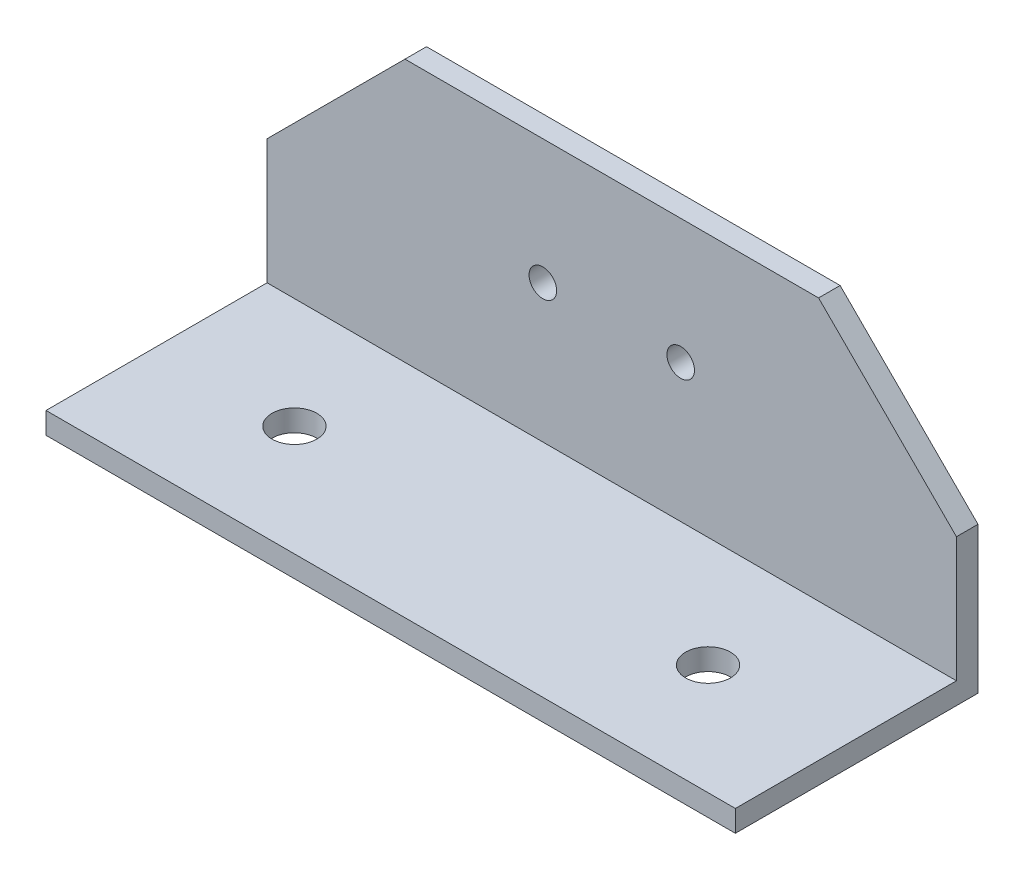
ISO-10303-21;
HEADER;
FILE_DESCRIPTION(('STEP AP214'),'2;1');
FILE_NAME('part.step','',(''),(''),'','','');
FILE_SCHEMA(('AUTOMOTIVE_DESIGN { 1 0 10303 214 1 1 1 1 }'));
ENDSEC;
DATA;
#1=APPLICATION_CONTEXT('core data for automotive mechanical design processes');
#2=APPLICATION_PROTOCOL_DEFINITION('international standard','automotive_design',2000,#1);
#3=PRODUCT_CONTEXT('',#1,'mechanical');
#4=PRODUCT('Part','Part','',(#3));
#5=PRODUCT_RELATED_PRODUCT_CATEGORY('part','',(#4));
#6=PRODUCT_DEFINITION_FORMATION('','',#4);
#7=PRODUCT_DEFINITION_CONTEXT('part definition',#1,'design');
#8=PRODUCT_DEFINITION('design','',#6,#7);
#9=PRODUCT_DEFINITION_SHAPE('','',#8);
#10=(LENGTH_UNIT() NAMED_UNIT(*) SI_UNIT(.MILLI.,.METRE.));
#11=(NAMED_UNIT(*) PLANE_ANGLE_UNIT() SI_UNIT($,.RADIAN.));
#12=(NAMED_UNIT(*) SI_UNIT($,.STERADIAN.) SOLID_ANGLE_UNIT());
#13=UNCERTAINTY_MEASURE_WITH_UNIT(LENGTH_MEASURE(1.E-05),#10,'distance_accuracy_value','');
#14=(GEOMETRIC_REPRESENTATION_CONTEXT(3) GLOBAL_UNCERTAINTY_ASSIGNED_CONTEXT((#13)) GLOBAL_UNIT_ASSIGNED_CONTEXT((#10,
#11,#12)) REPRESENTATION_CONTEXT('',''));
#15=CARTESIAN_POINT('',(0.,0.,0.));
#16=DIRECTION('',(0.,0.,1.));
#17=DIRECTION('',(1.,0.,0.));
#18=AXIS2_PLACEMENT_3D('',#15,#16,#17);
#19=CARTESIAN_POINT('',(100.,0.,-35.1979965784261));
#20=DIRECTION('',(0.,0.,1.));
#21=DIRECTION('',(1.,0.,0.));
#22=AXIS2_PLACEMENT_3D('',#19,#20,#21);
#23=PLANE('',#22);
#24=CARTESIAN_POINT('',(40.,20.,-35.1979965784261));
#25=DIRECTION('',(0.,0.,-1.));
#26=DIRECTION('',(1.,0.,0.));
#27=AXIS2_PLACEMENT_3D('',#24,#25,#26);
#28=CIRCLE('',#27,2.);
#29=CARTESIAN_POINT('',(42.,20.,-35.1979965784261));
#30=VERTEX_POINT('',#29);
#31=EDGE_CURVE('E156',#30,#30,#28,.T.);
#32=ORIENTED_EDGE('',*,*,#31,.F.);
#33=EDGE_LOOP('',(#32));
#34=FACE_BOUND('',#33,.T.);
#35=CARTESIAN_POINT('',(60.,20.,-35.1979965784261));
#36=DIRECTION('',(0.,0.,-1.));
#37=DIRECTION('',(-1.,0.,0.));
#38=AXIS2_PLACEMENT_3D('',#35,#36,#37);
#39=CIRCLE('',#38,2.);
#40=CARTESIAN_POINT('',(58.,20.,-35.1979965784261));
#41=VERTEX_POINT('',#40);
#42=EDGE_CURVE('E152',#41,#41,#39,.T.);
#43=ORIENTED_EDGE('',*,*,#42,.F.);
#44=EDGE_LOOP('',(#43));
#45=FACE_BOUND('',#44,.T.);
#46=DIRECTION('',(0.,1.,0.));
#47=VECTOR('',#46,1.);
#48=CARTESIAN_POINT('',(0.,0.,-35.1979965784261));
#49=LINE('',#48,#47);
#50=CARTESIAN_POINT('',(0.,-3.125,-35.1979965784261));
#51=VERTEX_POINT('',#50);
#52=CARTESIAN_POINT('',(0.,18.1,-35.1979965784261));
#53=VERTEX_POINT('',#52);
#54=EDGE_CURVE('E117',#51,#53,#49,.T.);
#55=ORIENTED_EDGE('',*,*,#54,.T.);
#56=DIRECTION('',(-0.707106781186549,-0.707106781186546,0.));
#57=VECTOR('',#56,1.);
#58=CARTESIAN_POINT('',(0.,18.1,-35.1979965784261));
#59=LINE('',#58,#57);
#60=CARTESIAN_POINT('',(20.0000000000001,38.1,-35.1979965784261));
#61=VERTEX_POINT('',#60);
#62=EDGE_CURVE('E160',#53,#61,#59,.F.);
#63=ORIENTED_EDGE('',*,*,#62,.T.);
#64=DIRECTION('',(-1.,0.,0.));
#65=VECTOR('',#64,1.);
#66=CARTESIAN_POINT('',(100.,38.1,-35.1979965784261));
#67=LINE('',#66,#65);
#68=CARTESIAN_POINT('',(80.,38.1,-35.1979965784261));
#69=VERTEX_POINT('',#68);
#70=EDGE_CURVE('E146',#69,#61,#67,.T.);
#71=ORIENTED_EDGE('',*,*,#70,.F.);
#72=DIRECTION('',(0.707106781186546,-0.707106781186549,0.));
#73=VECTOR('',#72,1.);
#74=CARTESIAN_POINT('',(80.,38.1,-35.1979965784261));
#75=LINE('',#74,#73);
#76=CARTESIAN_POINT('',(100.,18.0999999999999,-35.1979965784261));
#77=VERTEX_POINT('',#76);
#78=EDGE_CURVE('E158',#69,#77,#75,.T.);
#79=ORIENTED_EDGE('',*,*,#78,.T.);
#80=DIRECTION('',(0.,1.,0.));
#81=VECTOR('',#80,1.);
#82=CARTESIAN_POINT('',(100.,0.,-35.1979965784261));
#83=LINE('',#82,#81);
#84=CARTESIAN_POINT('',(100.,-3.125,-35.1979965784261));
#85=VERTEX_POINT('',#84);
#86=EDGE_CURVE('E129',#85,#77,#83,.T.);
#87=ORIENTED_EDGE('',*,*,#86,.F.);
#88=DIRECTION('',(-1.,0.,0.));
#89=VECTOR('',#88,1.);
#90=CARTESIAN_POINT('',(100.,-3.125,-35.1979965784261));
#91=LINE('',#90,#89);
#92=EDGE_CURVE('E139',#85,#51,#91,.T.);
#93=ORIENTED_EDGE('',*,*,#92,.T.);
#94=EDGE_LOOP('',(#55,#63,#71,#79,#87,#93));
#95=FACE_BOUND('',#94,.T.);
#96=ADVANCED_FACE('F32',(#34,#45,#95),#23,.F.);
#97=CARTESIAN_POINT('',(100.,38.1,-32.0729965784261));
#98=DIRECTION('',(0.,1.,0.));
#99=DIRECTION('',(0.,0.,1.));
#100=AXIS2_PLACEMENT_3D('',#97,#98,#99);
#101=PLANE('',#100);
#102=ORIENTED_EDGE('',*,*,#70,.T.);
#103=DIRECTION('',(0.,0.,1.));
#104=VECTOR('',#103,1.);
#105=CARTESIAN_POINT('',(20.0000000000001,38.1,-32.0729965784261));
#106=LINE('',#105,#104);
#107=CARTESIAN_POINT('',(20.,38.1,-32.0729965784261));
#108=VERTEX_POINT('',#107);
#109=EDGE_CURVE('E52',#61,#108,#106,.T.);
#110=ORIENTED_EDGE('',*,*,#109,.T.);
#111=DIRECTION('',(-1.,0.,0.));
#112=VECTOR('',#111,1.);
#113=CARTESIAN_POINT('',(100.,38.1,-32.0729965784261));
#114=LINE('',#113,#112);
#115=CARTESIAN_POINT('',(80.,38.1,-32.0729965784261));
#116=VERTEX_POINT('',#115);
#117=EDGE_CURVE('E107',#116,#108,#114,.T.);
#118=ORIENTED_EDGE('',*,*,#117,.F.);
#119=DIRECTION('',(0.,0.,-1.));
#120=VECTOR('',#119,1.);
#121=CARTESIAN_POINT('',(80.,38.1,-35.1979965784261));
#122=LINE('',#121,#120);
#123=EDGE_CURVE('E162',#116,#69,#122,.T.);
#124=ORIENTED_EDGE('',*,*,#123,.T.);
#125=EDGE_LOOP('',(#102,#110,#118,#124));
#126=FACE_BOUND('',#125,.T.);
#127=ADVANCED_FACE('F170',(#126),#101,.T.);
#128=CARTESIAN_POINT('',(100.,0.,-32.0729965784261));
#129=DIRECTION('',(0.,0.,1.));
#130=DIRECTION('',(1.,0.,0.));
#131=AXIS2_PLACEMENT_3D('',#128,#129,#130);
#132=PLANE('',#131);
#133=CARTESIAN_POINT('',(40.,20.,-32.0729965784261));
#134=DIRECTION('',(0.,0.,1.));
#135=DIRECTION('',(1.,0.,0.));
#136=AXIS2_PLACEMENT_3D('',#133,#134,#135);
#137=CIRCLE('',#136,2.);
#138=CARTESIAN_POINT('',(42.,20.,-32.0729965784261));
#139=VERTEX_POINT('',#138);
#140=EDGE_CURVE('E153',#139,#139,#137,.T.);
#141=ORIENTED_EDGE('',*,*,#140,.F.);
#142=EDGE_LOOP('',(#141));
#143=FACE_BOUND('',#142,.T.);
#144=CARTESIAN_POINT('',(60.,20.,-32.0729965784261));
#145=DIRECTION('',(0.,0.,1.));
#146=DIRECTION('',(1.,0.,0.));
#147=AXIS2_PLACEMENT_3D('',#144,#145,#146);
#148=CIRCLE('',#147,2.);
#149=CARTESIAN_POINT('',(62.,20.,-32.0729965784261));
#150=VERTEX_POINT('',#149);
#151=EDGE_CURVE('E149',#150,#150,#148,.T.);
#152=ORIENTED_EDGE('',*,*,#151,.F.);
#153=EDGE_LOOP('',(#152));
#154=FACE_BOUND('',#153,.T.);
#155=ORIENTED_EDGE('',*,*,#117,.T.);
#156=DIRECTION('',(0.707106781186549,0.707106781186546,0.));
#157=VECTOR('',#156,1.);
#158=CARTESIAN_POINT('',(40.9500000000002,59.05,-32.0729965784261));
#159=LINE('',#158,#157);
#160=CARTESIAN_POINT('',(0.,18.1,-32.0729965784261));
#161=VERTEX_POINT('',#160);
#162=EDGE_CURVE('E39',#108,#161,#159,.F.);
#163=ORIENTED_EDGE('',*,*,#162,.T.);
#164=DIRECTION('',(0.,1.,0.));
#165=VECTOR('',#164,1.);
#166=CARTESIAN_POINT('',(0.,0.,-32.0729965784261));
#167=LINE('',#166,#165);
#168=CARTESIAN_POINT('',(0.,0.,-32.0729965784261));
#169=VERTEX_POINT('',#168);
#170=EDGE_CURVE('E111',#169,#161,#167,.T.);
#171=ORIENTED_EDGE('',*,*,#170,.F.);
#172=DIRECTION('',(-1.,0.,0.));
#173=VECTOR('',#172,1.);
#174=CARTESIAN_POINT('',(100.,0.,-32.0729965784261));
#175=LINE('',#174,#173);
#176=CARTESIAN_POINT('',(100.,0.,-32.0729965784261));
#177=VERTEX_POINT('',#176);
#178=EDGE_CURVE('E98',#177,#169,#175,.T.);
#179=ORIENTED_EDGE('',*,*,#178,.F.);
#180=DIRECTION('',(0.,1.,0.));
#181=VECTOR('',#180,1.);
#182=CARTESIAN_POINT('',(100.,0.,-32.0729965784261));
#183=LINE('',#182,#181);
#184=CARTESIAN_POINT('',(100.,18.0999999999999,-32.0729965784261));
#185=VERTEX_POINT('',#184);
#186=EDGE_CURVE('E131',#177,#185,#183,.T.);
#187=ORIENTED_EDGE('',*,*,#186,.T.);
#188=DIRECTION('',(-0.707106781186546,0.707106781186549,0.));
#189=VECTOR('',#188,1.);
#190=CARTESIAN_POINT('',(109.05,9.04999999999993,-32.0729965784261));
#191=LINE('',#190,#189);
#192=EDGE_CURVE('E166',#185,#116,#191,.T.);
#193=ORIENTED_EDGE('',*,*,#192,.T.);
#194=EDGE_LOOP('',(#155,#163,#171,#179,#187,#193));
#195=FACE_BOUND('',#194,.T.);
#196=ADVANCED_FACE('F112',(#143,#154,#195),#132,.T.);
#197=CARTESIAN_POINT('',(100.,0.,0.));
#198=DIRECTION('',(0.,1.,0.));
#199=DIRECTION('',(0.,0.,1.));
#200=AXIS2_PLACEMENT_3D('',#197,#198,#199);
#201=PLANE('',#200);
#202=CARTESIAN_POINT('',(20.,0.,-16.0364982892131));
#203=DIRECTION('',(0.,1.,0.));
#204=DIRECTION('',(0.,0.,-1.));
#205=AXIS2_PLACEMENT_3D('',#202,#203,#204);
#206=CIRCLE('',#205,3.25000000000001);
#207=CARTESIAN_POINT('',(20.,0.,-19.2864982892131));
#208=VERTEX_POINT('',#207);
#209=EDGE_CURVE('E197',#208,#208,#206,.T.);
#210=ORIENTED_EDGE('',*,*,#209,.F.);
#211=EDGE_LOOP('',(#210));
#212=FACE_BOUND('',#211,.T.);
#213=CARTESIAN_POINT('',(80.,0.,-16.036498289213));
#214=DIRECTION('',(0.,1.,0.));
#215=DIRECTION('',(0.,0.,1.));
#216=AXIS2_PLACEMENT_3D('',#213,#214,#215);
#217=CIRCLE('',#216,3.25000000000001);
#218=CARTESIAN_POINT('',(80.,0.,-12.786498289213));
#219=VERTEX_POINT('',#218);
#220=EDGE_CURVE('E191',#219,#219,#217,.T.);
#221=ORIENTED_EDGE('',*,*,#220,.F.);
#222=EDGE_LOOP('',(#221));
#223=FACE_BOUND('',#222,.T.);
#224=DIRECTION('',(0.,0.,-1.));
#225=VECTOR('',#224,1.);
#226=CARTESIAN_POINT('',(0.,0.,0.));
#227=LINE('',#226,#225);
#228=CARTESIAN_POINT('',(0.,0.,0.));
#229=VERTEX_POINT('',#228);
#230=EDGE_CURVE('E102',#229,#169,#227,.T.);
#231=ORIENTED_EDGE('',*,*,#230,.F.);
#232=DIRECTION('',(-1.,0.,0.));
#233=VECTOR('',#232,1.);
#234=CARTESIAN_POINT('',(100.,0.,0.));
#235=LINE('',#234,#233);
#236=CARTESIAN_POINT('',(100.,0.,0.));
#237=VERTEX_POINT('',#236);
#238=EDGE_CURVE('E108',#237,#229,#235,.T.);
#239=ORIENTED_EDGE('',*,*,#238,.F.);
#240=DIRECTION('',(0.,0.,-1.));
#241=VECTOR('',#240,1.);
#242=CARTESIAN_POINT('',(100.,0.,0.));
#243=LINE('',#242,#241);
#244=EDGE_CURVE('E105',#237,#177,#243,.T.);
#245=ORIENTED_EDGE('',*,*,#244,.T.);
#246=ORIENTED_EDGE('',*,*,#178,.T.);
#247=EDGE_LOOP('',(#231,#239,#245,#246));
#248=FACE_BOUND('',#247,.T.);
#249=ADVANCED_FACE('F100',(#212,#223,#248),#201,.T.);
#250=CARTESIAN_POINT('',(100.,-3.125,0.));
#251=DIRECTION('',(0.,0.,1.));
#252=DIRECTION('',(1.,0.,0.));
#253=AXIS2_PLACEMENT_3D('',#250,#251,#252);
#254=PLANE('',#253);
#255=DIRECTION('',(0.,1.,0.));
#256=VECTOR('',#255,1.);
#257=CARTESIAN_POINT('',(0.,-3.125,0.));
#258=LINE('',#257,#256);
#259=CARTESIAN_POINT('',(0.,-3.125,0.));
#260=VERTEX_POINT('',#259);
#261=EDGE_CURVE('E122',#260,#229,#258,.T.);
#262=ORIENTED_EDGE('',*,*,#261,.F.);
#263=DIRECTION('',(-1.,0.,0.));
#264=VECTOR('',#263,1.);
#265=CARTESIAN_POINT('',(100.,-3.125,0.));
#266=LINE('',#265,#264);
#267=CARTESIAN_POINT('',(100.,-3.125,0.));
#268=VERTEX_POINT('',#267);
#269=EDGE_CURVE('E142',#268,#260,#266,.T.);
#270=ORIENTED_EDGE('',*,*,#269,.F.);
#271=DIRECTION('',(0.,1.,0.));
#272=VECTOR('',#271,1.);
#273=CARTESIAN_POINT('',(100.,-3.125,0.));
#274=LINE('',#273,#272);
#275=EDGE_CURVE('E134',#268,#237,#274,.T.);
#276=ORIENTED_EDGE('',*,*,#275,.T.);
#277=ORIENTED_EDGE('',*,*,#238,.T.);
#278=EDGE_LOOP('',(#262,#270,#276,#277));
#279=FACE_BOUND('',#278,.T.);
#280=ADVANCED_FACE('F205',(#279),#254,.T.);
#281=CARTESIAN_POINT('',(100.,-3.125,0.));
#282=DIRECTION('',(0.,1.,0.));
#283=DIRECTION('',(0.,0.,1.));
#284=AXIS2_PLACEMENT_3D('',#281,#282,#283);
#285=PLANE('',#284);
#286=CARTESIAN_POINT('',(20.,-3.125,-16.0364982892131));
#287=DIRECTION('',(0.,1.,0.));
#288=DIRECTION('',(0.,0.,-1.));
#289=AXIS2_PLACEMENT_3D('',#286,#287,#288);
#290=CIRCLE('',#289,3.25000000000001);
#291=CARTESIAN_POINT('',(20.,-3.125,-19.2864982892131));
#292=VERTEX_POINT('',#291);
#293=EDGE_CURVE('E194',#292,#292,#290,.T.);
#294=ORIENTED_EDGE('',*,*,#293,.T.);
#295=EDGE_LOOP('',(#294));
#296=FACE_BOUND('',#295,.T.);
#297=CARTESIAN_POINT('',(80.,-3.125,-16.036498289213));
#298=DIRECTION('',(0.,1.,0.));
#299=DIRECTION('',(0.,0.,1.));
#300=AXIS2_PLACEMENT_3D('',#297,#298,#299);
#301=CIRCLE('',#300,3.25000000000001);
#302=CARTESIAN_POINT('',(80.,-3.125,-12.786498289213));
#303=VERTEX_POINT('',#302);
#304=EDGE_CURVE('E188',#303,#303,#301,.T.);
#305=ORIENTED_EDGE('',*,*,#304,.T.);
#306=EDGE_LOOP('',(#305));
#307=FACE_BOUND('',#306,.T.);
#308=DIRECTION('',(0.,0.,-1.));
#309=VECTOR('',#308,1.);
#310=CARTESIAN_POINT('',(0.,-3.125,0.));
#311=LINE('',#310,#309);
#312=EDGE_CURVE('E124',#260,#51,#311,.T.);
#313=ORIENTED_EDGE('',*,*,#312,.T.);
#314=ORIENTED_EDGE('',*,*,#92,.F.);
#315=DIRECTION('',(0.,0.,-1.));
#316=VECTOR('',#315,1.);
#317=CARTESIAN_POINT('',(100.,-3.125,0.));
#318=LINE('',#317,#316);
#319=EDGE_CURVE('E137',#268,#85,#318,.T.);
#320=ORIENTED_EDGE('',*,*,#319,.F.);
#321=ORIENTED_EDGE('',*,*,#269,.T.);
#322=EDGE_LOOP('',(#313,#314,#320,#321));
#323=FACE_BOUND('',#322,.T.);
#324=ADVANCED_FACE('F181',(#296,#307,#323),#285,.F.);
#325=CARTESIAN_POINT('',(100.,0.,-35.1979965784261));
#326=DIRECTION('',(-1.,0.,0.));
#327=DIRECTION('',(0.,0.,1.));
#328=AXIS2_PLACEMENT_3D('',#325,#326,#327);
#329=PLANE('',#328);
#330=ORIENTED_EDGE('',*,*,#86,.T.);
#331=DIRECTION('',(0.,0.,1.));
#332=VECTOR('',#331,1.);
#333=CARTESIAN_POINT('',(100.,18.0999999999999,-32.072996578426));
#334=LINE('',#333,#332);
#335=EDGE_CURVE('E11',#77,#185,#334,.T.);
#336=ORIENTED_EDGE('',*,*,#335,.T.);
#337=ORIENTED_EDGE('',*,*,#186,.F.);
#338=ORIENTED_EDGE('',*,*,#244,.F.);
#339=ORIENTED_EDGE('',*,*,#275,.F.);
#340=ORIENTED_EDGE('',*,*,#319,.T.);
#341=EDGE_LOOP('',(#330,#336,#337,#338,#339,#340));
#342=FACE_BOUND('',#341,.T.);
#343=ADVANCED_FACE('F176',(#342),#329,.F.);
#344=CARTESIAN_POINT('',(0.,0.,-35.1979965784261));
#345=DIRECTION('',(-1.,0.,0.));
#346=DIRECTION('',(0.,0.,1.));
#347=AXIS2_PLACEMENT_3D('',#344,#345,#346);
#348=PLANE('',#347);
#349=ORIENTED_EDGE('',*,*,#170,.T.);
#350=DIRECTION('',(0.,0.,-1.));
#351=VECTOR('',#350,1.);
#352=CARTESIAN_POINT('',(0.,18.1,-35.1979965784262));
#353=LINE('',#352,#351);
#354=EDGE_CURVE('E148',#161,#53,#353,.T.);
#355=ORIENTED_EDGE('',*,*,#354,.T.);
#356=ORIENTED_EDGE('',*,*,#54,.F.);
#357=ORIENTED_EDGE('',*,*,#312,.F.);
#358=ORIENTED_EDGE('',*,*,#261,.T.);
#359=ORIENTED_EDGE('',*,*,#230,.T.);
#360=EDGE_LOOP('',(#349,#355,#356,#357,#358,#359));
#361=FACE_BOUND('',#360,.T.);
#362=ADVANCED_FACE('F119',(#361),#348,.T.);
#363=CARTESIAN_POINT('',(60.,20.,0.));
#364=DIRECTION('',(0.,0.,-1.));
#365=DIRECTION('',(-1.,0.,0.));
#366=AXIS2_PLACEMENT_3D('',#363,#364,#365);
#367=CYLINDRICAL_SURFACE('',#366,2.);
#368=ORIENTED_EDGE('',*,*,#151,.T.);
#369=EDGE_LOOP('',(#368));
#370=FACE_BOUND('',#369,.T.);
#371=ORIENTED_EDGE('',*,*,#42,.T.);
#372=EDGE_LOOP('',(#371));
#373=FACE_BOUND('',#372,.T.);
#374=ADVANCED_FACE('F231',(#370,#373),#367,.F.);
#375=CARTESIAN_POINT('',(40.,20.,0.));
#376=DIRECTION('',(0.,0.,-1.));
#377=DIRECTION('',(-1.,0.,0.));
#378=AXIS2_PLACEMENT_3D('',#375,#376,#377);
#379=CYLINDRICAL_SURFACE('',#378,2.);
#380=ORIENTED_EDGE('',*,*,#140,.T.);
#381=EDGE_LOOP('',(#380));
#382=FACE_BOUND('',#381,.T.);
#383=ORIENTED_EDGE('',*,*,#31,.T.);
#384=EDGE_LOOP('',(#383));
#385=FACE_BOUND('',#384,.T.);
#386=ADVANCED_FACE('F233',(#382,#385),#379,.F.);
#387=CARTESIAN_POINT('',(0.,18.1,-35.1979965784262));
#388=DIRECTION('',(0.707106781186546,-0.707106781186549,0.));
#389=DIRECTION('',(0.707106781186549,0.707106781186546,0.));
#390=AXIS2_PLACEMENT_3D('',#387,#388,#389);
#391=PLANE('',#390);
#392=ORIENTED_EDGE('',*,*,#162,.F.);
#393=ORIENTED_EDGE('',*,*,#109,.F.);
#394=ORIENTED_EDGE('',*,*,#62,.F.);
#395=ORIENTED_EDGE('',*,*,#354,.F.);
#396=EDGE_LOOP('',(#392,#393,#394,#395));
#397=FACE_BOUND('',#396,.T.);
#398=ADVANCED_FACE('F219',(#397),#391,.F.);
#399=CARTESIAN_POINT('',(80.,38.1,-32.0729965784261));
#400=DIRECTION('',(0.707106781186548,0.707106781186546,0.));
#401=DIRECTION('',(-0.707106781186546,0.707106781186549,0.));
#402=AXIS2_PLACEMENT_3D('',#399,#400,#401);
#403=PLANE('',#402);
#404=ORIENTED_EDGE('',*,*,#192,.F.);
#405=ORIENTED_EDGE('',*,*,#335,.F.);
#406=ORIENTED_EDGE('',*,*,#78,.F.);
#407=ORIENTED_EDGE('',*,*,#123,.F.);
#408=EDGE_LOOP('',(#404,#405,#406,#407));
#409=FACE_BOUND('',#408,.T.);
#410=ADVANCED_FACE('F172',(#409),#403,.T.);
#411=CARTESIAN_POINT('',(80.,-3.125,-16.036498289213));
#412=DIRECTION('',(0.,1.,0.));
#413=DIRECTION('',(0.,0.,1.));
#414=AXIS2_PLACEMENT_3D('',#411,#412,#413);
#415=CYLINDRICAL_SURFACE('',#414,3.25000000000001);
#416=ORIENTED_EDGE('',*,*,#304,.F.);
#417=EDGE_LOOP('',(#416));
#418=FACE_BOUND('',#417,.T.);
#419=ORIENTED_EDGE('',*,*,#220,.T.);
#420=EDGE_LOOP('',(#419));
#421=FACE_BOUND('',#420,.T.);
#422=ADVANCED_FACE('F209',(#418,#421),#415,.F.);
#423=CARTESIAN_POINT('',(20.,-3.125,-16.0364982892131));
#424=DIRECTION('',(0.,1.,0.));
#425=DIRECTION('',(0.,0.,1.));
#426=AXIS2_PLACEMENT_3D('',#423,#424,#425);
#427=CYLINDRICAL_SURFACE('',#426,3.25000000000001);
#428=ORIENTED_EDGE('',*,*,#293,.F.);
#429=EDGE_LOOP('',(#428));
#430=FACE_BOUND('',#429,.T.);
#431=ORIENTED_EDGE('',*,*,#209,.T.);
#432=EDGE_LOOP('',(#431));
#433=FACE_BOUND('',#432,.T.);
#434=ADVANCED_FACE('F201',(#430,#433),#427,.F.);
#435=CLOSED_SHELL('',(#96,#127,#196,#249,#280,#324,#343,#362,#374,#386,#398,#410,#422,#434));
#436=MANIFOLD_SOLID_BREP('B2',#435);
#437=ADVANCED_BREP_SHAPE_REPRESENTATION('',(#18,#436),#14);
#438=SHAPE_DEFINITION_REPRESENTATION(#9,#437);
ENDSEC;
END-ISO-10303-21;
